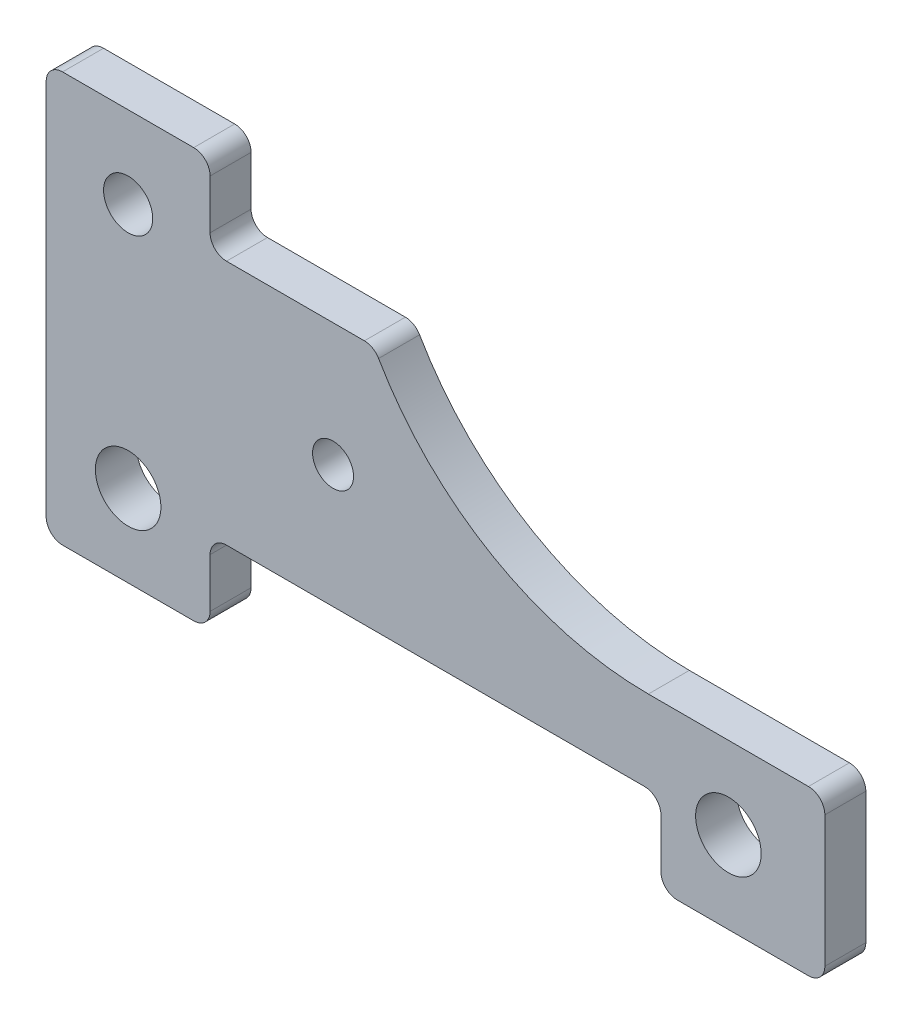
ISO-10303-21;
HEADER;
FILE_DESCRIPTION(('STEP AP214'),'2;1');
FILE_NAME('part.step','',(''),(''),'','','');
FILE_SCHEMA(('AUTOMOTIVE_DESIGN { 1 0 10303 214 1 1 1 1 }'));
ENDSEC;
DATA;
#1=APPLICATION_CONTEXT('core data for automotive mechanical design processes');
#2=APPLICATION_PROTOCOL_DEFINITION('international standard','automotive_design',2000,#1);
#3=PRODUCT_CONTEXT('',#1,'mechanical');
#4=PRODUCT('Part','Part','',(#3));
#5=PRODUCT_RELATED_PRODUCT_CATEGORY('part','',(#4));
#6=PRODUCT_DEFINITION_FORMATION('','',#4);
#7=PRODUCT_DEFINITION_CONTEXT('part definition',#1,'design');
#8=PRODUCT_DEFINITION('design','',#6,#7);
#9=PRODUCT_DEFINITION_SHAPE('','',#8);
#10=(LENGTH_UNIT() NAMED_UNIT(*) SI_UNIT(.MILLI.,.METRE.));
#11=(NAMED_UNIT(*) PLANE_ANGLE_UNIT() SI_UNIT($,.RADIAN.));
#12=(NAMED_UNIT(*) SI_UNIT($,.STERADIAN.) SOLID_ANGLE_UNIT());
#13=UNCERTAINTY_MEASURE_WITH_UNIT(LENGTH_MEASURE(1.E-05),#10,'distance_accuracy_value','');
#14=(GEOMETRIC_REPRESENTATION_CONTEXT(3) GLOBAL_UNCERTAINTY_ASSIGNED_CONTEXT((#13)) GLOBAL_UNIT_ASSIGNED_CONTEXT((#10,
#11,#12)) REPRESENTATION_CONTEXT('',''));
#15=CARTESIAN_POINT('',(0.,0.,0.));
#16=DIRECTION('',(0.,0.,1.));
#17=DIRECTION('',(1.,0.,0.));
#18=AXIS2_PLACEMENT_3D('',#15,#16,#17);
#19=CARTESIAN_POINT('',(734.66401061363,580.,25.));
#20=DIRECTION('',(0.,0.,-1.));
#21=DIRECTION('',(-1.,0.,0.));
#22=AXIS2_PLACEMENT_3D('',#19,#20,#21);
#23=CYLINDRICAL_SURFACE('',#22,380.);
#24=CARTESIAN_POINT('',(734.66401061363,580.,-25.));
#25=DIRECTION('',(0.,0.,-1.));
#26=DIRECTION('',(-1.,0.,0.));
#27=AXIS2_PLACEMENT_3D('',#24,#25,#26);
#28=CIRCLE('',#27,380.);
#29=CARTESIAN_POINT('',(734.66401061363,200.,-25.));
#30=VERTEX_POINT('',#29);
#31=CARTESIAN_POINT('',(405.574357175544,390.,-25.));
#32=VERTEX_POINT('',#31);
#33=EDGE_CURVE('E221',#30,#32,#28,.T.);
#34=ORIENTED_EDGE('',*,*,#33,.T.);
#35=DIRECTION('',(0.,0.,-1.));
#36=VECTOR('',#35,1.);
#37=CARTESIAN_POINT('',(405.574357175544,390.,25.));
#38=LINE('',#37,#36);
#39=CARTESIAN_POINT('',(405.574357175544,390.,25.));
#40=VERTEX_POINT('',#39);
#41=EDGE_CURVE('E11',#40,#32,#38,.T.);
#42=ORIENTED_EDGE('',*,*,#41,.F.);
#43=CARTESIAN_POINT('',(734.66401061363,580.,25.));
#44=DIRECTION('',(0.,0.,-1.));
#45=DIRECTION('',(-1.,0.,0.));
#46=AXIS2_PLACEMENT_3D('',#43,#44,#45);
#47=CIRCLE('',#46,380.);
#48=CARTESIAN_POINT('',(734.66401061363,200.,25.));
#49=VERTEX_POINT('',#48);
#50=EDGE_CURVE('E266',#49,#40,#47,.T.);
#51=ORIENTED_EDGE('',*,*,#50,.F.);
#52=DIRECTION('',(0.,0.,-1.));
#53=VECTOR('',#52,1.);
#54=CARTESIAN_POINT('',(734.66401061363,200.,25.));
#55=LINE('',#54,#53);
#56=EDGE_CURVE('E217',#49,#30,#55,.T.);
#57=ORIENTED_EDGE('',*,*,#56,.T.);
#58=EDGE_LOOP('',(#34,#42,#51,#57));
#59=FACE_BOUND('',#58,.T.);
#60=ADVANCED_FACE('F35',(#59),#23,.F.);
#61=CARTESIAN_POINT('',(388.253849099855,380.,25.));
#62=DIRECTION('',(0.,0.,-1.));
#63=DIRECTION('',(-1.,0.,0.));
#64=AXIS2_PLACEMENT_3D('',#61,#62,#63);
#65=CYLINDRICAL_SURFACE('',#64,20.);
#66=CARTESIAN_POINT('',(388.253849099855,380.,-25.));
#67=DIRECTION('',(0.,0.,1.));
#68=DIRECTION('',(1.,0.,0.));
#69=AXIS2_PLACEMENT_3D('',#66,#67,#68);
#70=CIRCLE('',#69,20.);
#71=CARTESIAN_POINT('',(388.253849099855,400.,-25.));
#72=VERTEX_POINT('',#71);
#73=EDGE_CURVE('E224',#32,#72,#70,.T.);
#74=ORIENTED_EDGE('',*,*,#73,.T.);
#75=DIRECTION('',(0.,0.,-1.));
#76=VECTOR('',#75,1.);
#77=CARTESIAN_POINT('',(388.253849099855,400.,25.));
#78=LINE('',#77,#76);
#79=CARTESIAN_POINT('',(388.253849099855,400.,25.));
#80=VERTEX_POINT('',#79);
#81=EDGE_CURVE('E43',#80,#72,#78,.T.);
#82=ORIENTED_EDGE('',*,*,#81,.F.);
#83=CARTESIAN_POINT('',(388.253849099855,380.,25.));
#84=DIRECTION('',(0.,0.,1.));
#85=DIRECTION('',(1.,0.,0.));
#86=AXIS2_PLACEMENT_3D('',#83,#84,#85);
#87=CIRCLE('',#86,20.);
#88=EDGE_CURVE('E139',#40,#80,#87,.T.);
#89=ORIENTED_EDGE('',*,*,#88,.F.);
#90=ORIENTED_EDGE('',*,*,#41,.T.);
#91=EDGE_LOOP('',(#74,#82,#89,#90));
#92=FACE_BOUND('',#91,.T.);
#93=ADVANCED_FACE('F400',(#92),#65,.T.);
#94=CARTESIAN_POINT('',(220.,400.,25.));
#95=DIRECTION('',(0.,-1.,0.));
#96=DIRECTION('',(0.,0.,-1.));
#97=AXIS2_PLACEMENT_3D('',#94,#95,#96);
#98=PLANE('',#97);
#99=DIRECTION('',(-1.,0.,0.));
#100=VECTOR('',#99,1.);
#101=CARTESIAN_POINT('',(220.,400.,-25.));
#102=LINE('',#101,#100);
#103=CARTESIAN_POINT('',(220.,400.,-25.));
#104=VERTEX_POINT('',#103);
#105=EDGE_CURVE('E227',#72,#104,#102,.T.);
#106=ORIENTED_EDGE('',*,*,#105,.T.);
#107=DIRECTION('',(0.,0.,-1.));
#108=VECTOR('',#107,1.);
#109=CARTESIAN_POINT('',(220.,400.,25.));
#110=LINE('',#109,#108);
#111=CARTESIAN_POINT('',(220.,400.,25.));
#112=VERTEX_POINT('',#111);
#113=EDGE_CURVE('E318',#112,#104,#110,.T.);
#114=ORIENTED_EDGE('',*,*,#113,.F.);
#115=DIRECTION('',(-1.,0.,0.));
#116=VECTOR('',#115,1.);
#117=CARTESIAN_POINT('',(220.,400.,25.));
#118=LINE('',#117,#116);
#119=EDGE_CURVE('E326',#80,#112,#118,.T.);
#120=ORIENTED_EDGE('',*,*,#119,.F.);
#121=ORIENTED_EDGE('',*,*,#81,.T.);
#122=EDGE_LOOP('',(#106,#114,#120,#121));
#123=FACE_BOUND('',#122,.T.);
#124=ADVANCED_FACE('F324',(#123),#98,.F.);
#125=CARTESIAN_POINT('',(220.,420.,25.));
#126=DIRECTION('',(0.,0.,-1.));
#127=DIRECTION('',(-1.,0.,0.));
#128=AXIS2_PLACEMENT_3D('',#125,#126,#127);
#129=CYLINDRICAL_SURFACE('',#128,20.);
#130=CARTESIAN_POINT('',(220.,420.,-25.));
#131=DIRECTION('',(0.,0.,-1.));
#132=DIRECTION('',(-1.,0.,0.));
#133=AXIS2_PLACEMENT_3D('',#130,#131,#132);
#134=CIRCLE('',#133,20.);
#135=CARTESIAN_POINT('',(200.,420.,-25.));
#136=VERTEX_POINT('',#135);
#137=EDGE_CURVE('E229',#104,#136,#134,.T.);
#138=ORIENTED_EDGE('',*,*,#137,.T.);
#139=DIRECTION('',(0.,0.,-1.));
#140=VECTOR('',#139,1.);
#141=CARTESIAN_POINT('',(200.,420.,25.));
#142=LINE('',#141,#140);
#143=CARTESIAN_POINT('',(200.,420.,25.));
#144=VERTEX_POINT('',#143);
#145=EDGE_CURVE('E315',#144,#136,#142,.T.);
#146=ORIENTED_EDGE('',*,*,#145,.F.);
#147=CARTESIAN_POINT('',(220.,420.,25.));
#148=DIRECTION('',(0.,0.,-1.));
#149=DIRECTION('',(-1.,0.,0.));
#150=AXIS2_PLACEMENT_3D('',#147,#148,#149);
#151=CIRCLE('',#150,20.);
#152=EDGE_CURVE('E344',#112,#144,#151,.T.);
#153=ORIENTED_EDGE('',*,*,#152,.F.);
#154=ORIENTED_EDGE('',*,*,#113,.T.);
#155=EDGE_LOOP('',(#138,#146,#153,#154));
#156=FACE_BOUND('',#155,.T.);
#157=ADVANCED_FACE('F335',(#156),#129,.F.);
#158=CARTESIAN_POINT('',(200.,480.,25.));
#159=DIRECTION('',(-1.,0.,0.));
#160=DIRECTION('',(0.,0.,1.));
#161=AXIS2_PLACEMENT_3D('',#158,#159,#160);
#162=PLANE('',#161);
#163=DIRECTION('',(0.,1.,0.));
#164=VECTOR('',#163,1.);
#165=CARTESIAN_POINT('',(200.,480.,-25.));
#166=LINE('',#165,#164);
#167=CARTESIAN_POINT('',(200.,480.,-25.));
#168=VERTEX_POINT('',#167);
#169=EDGE_CURVE('E231',#136,#168,#166,.T.);
#170=ORIENTED_EDGE('',*,*,#169,.T.);
#171=DIRECTION('',(0.,0.,-1.));
#172=VECTOR('',#171,1.);
#173=CARTESIAN_POINT('',(200.,480.,25.));
#174=LINE('',#173,#172);
#175=CARTESIAN_POINT('',(200.,480.,25.));
#176=VERTEX_POINT('',#175);
#177=EDGE_CURVE('E312',#176,#168,#174,.T.);
#178=ORIENTED_EDGE('',*,*,#177,.F.);
#179=DIRECTION('',(0.,1.,0.));
#180=VECTOR('',#179,1.);
#181=CARTESIAN_POINT('',(200.,480.,25.));
#182=LINE('',#181,#180);
#183=EDGE_CURVE('E341',#144,#176,#182,.T.);
#184=ORIENTED_EDGE('',*,*,#183,.F.);
#185=ORIENTED_EDGE('',*,*,#145,.T.);
#186=EDGE_LOOP('',(#170,#178,#184,#185));
#187=FACE_BOUND('',#186,.T.);
#188=ADVANCED_FACE('F339',(#187),#162,.F.);
#189=CARTESIAN_POINT('',(180.,480.,25.));
#190=DIRECTION('',(0.,0.,-1.));
#191=DIRECTION('',(-1.,0.,0.));
#192=AXIS2_PLACEMENT_3D('',#189,#190,#191);
#193=CYLINDRICAL_SURFACE('',#192,20.);
#194=CARTESIAN_POINT('',(180.,480.,-25.));
#195=DIRECTION('',(0.,0.,1.));
#196=DIRECTION('',(1.,0.,0.));
#197=AXIS2_PLACEMENT_3D('',#194,#195,#196);
#198=CIRCLE('',#197,20.);
#199=CARTESIAN_POINT('',(180.,500.,-25.));
#200=VERTEX_POINT('',#199);
#201=EDGE_CURVE('E233',#168,#200,#198,.T.);
#202=ORIENTED_EDGE('',*,*,#201,.T.);
#203=DIRECTION('',(0.,0.,-1.));
#204=VECTOR('',#203,1.);
#205=CARTESIAN_POINT('',(180.,500.,25.));
#206=LINE('',#205,#204);
#207=CARTESIAN_POINT('',(180.,500.,25.));
#208=VERTEX_POINT('',#207);
#209=EDGE_CURVE('E309',#208,#200,#206,.T.);
#210=ORIENTED_EDGE('',*,*,#209,.F.);
#211=CARTESIAN_POINT('',(180.,480.,25.));
#212=DIRECTION('',(0.,0.,1.));
#213=DIRECTION('',(1.,0.,0.));
#214=AXIS2_PLACEMENT_3D('',#211,#212,#213);
#215=CIRCLE('',#214,20.);
#216=EDGE_CURVE('E343',#176,#208,#215,.T.);
#217=ORIENTED_EDGE('',*,*,#216,.F.);
#218=ORIENTED_EDGE('',*,*,#177,.T.);
#219=EDGE_LOOP('',(#202,#210,#217,#218));
#220=FACE_BOUND('',#219,.T.);
#221=ADVANCED_FACE('F413',(#220),#193,.T.);
#222=CARTESIAN_POINT('',(20.0000000000001,500.,25.));
#223=DIRECTION('',(0.,-1.,0.));
#224=DIRECTION('',(0.,0.,-1.));
#225=AXIS2_PLACEMENT_3D('',#222,#223,#224);
#226=PLANE('',#225);
#227=DIRECTION('',(-1.,0.,0.));
#228=VECTOR('',#227,1.);
#229=CARTESIAN_POINT('',(20.0000000000001,500.,-25.));
#230=LINE('',#229,#228);
#231=CARTESIAN_POINT('',(20.0000000000001,500.,-25.));
#232=VERTEX_POINT('',#231);
#233=EDGE_CURVE('E235',#200,#232,#230,.T.);
#234=ORIENTED_EDGE('',*,*,#233,.T.);
#235=DIRECTION('',(0.,0.,-1.));
#236=VECTOR('',#235,1.);
#237=CARTESIAN_POINT('',(20.0000000000001,500.,25.));
#238=LINE('',#237,#236);
#239=CARTESIAN_POINT('',(20.0000000000001,500.,25.));
#240=VERTEX_POINT('',#239);
#241=EDGE_CURVE('E306',#240,#232,#238,.T.);
#242=ORIENTED_EDGE('',*,*,#241,.F.);
#243=DIRECTION('',(-1.,0.,0.));
#244=VECTOR('',#243,1.);
#245=CARTESIAN_POINT('',(20.0000000000001,500.,25.));
#246=LINE('',#245,#244);
#247=EDGE_CURVE('E346',#208,#240,#246,.T.);
#248=ORIENTED_EDGE('',*,*,#247,.F.);
#249=ORIENTED_EDGE('',*,*,#209,.T.);
#250=EDGE_LOOP('',(#234,#242,#248,#249));
#251=FACE_BOUND('',#250,.T.);
#252=ADVANCED_FACE('F416',(#251),#226,.F.);
#253=CARTESIAN_POINT('',(20.,480.,25.));
#254=DIRECTION('',(0.,0.,-1.));
#255=DIRECTION('',(-1.,0.,0.));
#256=AXIS2_PLACEMENT_3D('',#253,#254,#255);
#257=CYLINDRICAL_SURFACE('',#256,20.);
#258=CARTESIAN_POINT('',(20.,480.,-25.));
#259=DIRECTION('',(0.,0.,1.));
#260=DIRECTION('',(-1.,0.,0.));
#261=AXIS2_PLACEMENT_3D('',#258,#259,#260);
#262=CIRCLE('',#261,20.);
#263=CARTESIAN_POINT('',(0.,480.,-25.));
#264=VERTEX_POINT('',#263);
#265=EDGE_CURVE('E237',#232,#264,#262,.T.);
#266=ORIENTED_EDGE('',*,*,#265,.T.);
#267=DIRECTION('',(0.,0.,-1.));
#268=VECTOR('',#267,1.);
#269=CARTESIAN_POINT('',(0.,480.,25.));
#270=LINE('',#269,#268);
#271=CARTESIAN_POINT('',(0.,480.,25.));
#272=VERTEX_POINT('',#271);
#273=EDGE_CURVE('E303',#272,#264,#270,.T.);
#274=ORIENTED_EDGE('',*,*,#273,.F.);
#275=CARTESIAN_POINT('',(20.,480.,25.));
#276=DIRECTION('',(0.,0.,1.));
#277=DIRECTION('',(-1.,0.,0.));
#278=AXIS2_PLACEMENT_3D('',#275,#276,#277);
#279=CIRCLE('',#278,20.);
#280=EDGE_CURVE('E352',#240,#272,#279,.T.);
#281=ORIENTED_EDGE('',*,*,#280,.F.);
#282=ORIENTED_EDGE('',*,*,#241,.T.);
#283=EDGE_LOOP('',(#266,#274,#281,#282));
#284=FACE_BOUND('',#283,.T.);
#285=ADVANCED_FACE('F420',(#284),#257,.T.);
#286=CARTESIAN_POINT('',(0.,20.0000000000001,25.));
#287=DIRECTION('',(1.,0.,0.));
#288=DIRECTION('',(0.,0.,-1.));
#289=AXIS2_PLACEMENT_3D('',#286,#287,#288);
#290=PLANE('',#289);
#291=DIRECTION('',(0.,-1.,0.));
#292=VECTOR('',#291,1.);
#293=CARTESIAN_POINT('',(0.,20.0000000000001,-25.));
#294=LINE('',#293,#292);
#295=CARTESIAN_POINT('',(0.,20.0000000000001,-25.));
#296=VERTEX_POINT('',#295);
#297=EDGE_CURVE('E239',#264,#296,#294,.T.);
#298=ORIENTED_EDGE('',*,*,#297,.T.);
#299=DIRECTION('',(0.,0.,-1.));
#300=VECTOR('',#299,1.);
#301=CARTESIAN_POINT('',(0.,20.0000000000001,25.));
#302=LINE('',#301,#300);
#303=CARTESIAN_POINT('',(0.,20.0000000000001,25.));
#304=VERTEX_POINT('',#303);
#305=EDGE_CURVE('E300',#304,#296,#302,.T.);
#306=ORIENTED_EDGE('',*,*,#305,.F.);
#307=DIRECTION('',(0.,-1.,0.));
#308=VECTOR('',#307,1.);
#309=CARTESIAN_POINT('',(0.,20.0000000000001,25.));
#310=LINE('',#309,#308);
#311=EDGE_CURVE('E354',#272,#304,#310,.T.);
#312=ORIENTED_EDGE('',*,*,#311,.F.);
#313=ORIENTED_EDGE('',*,*,#273,.T.);
#314=EDGE_LOOP('',(#298,#306,#312,#313));
#315=FACE_BOUND('',#314,.T.);
#316=ADVANCED_FACE('F424',(#315),#290,.F.);
#317=CARTESIAN_POINT('',(20.,20.,25.));
#318=DIRECTION('',(0.,0.,-1.));
#319=DIRECTION('',(-1.,0.,0.));
#320=AXIS2_PLACEMENT_3D('',#317,#318,#319);
#321=CYLINDRICAL_SURFACE('',#320,20.);
#322=CARTESIAN_POINT('',(20.,20.,-25.));
#323=DIRECTION('',(0.,0.,1.));
#324=DIRECTION('',(1.,0.,0.));
#325=AXIS2_PLACEMENT_3D('',#322,#323,#324);
#326=CIRCLE('',#325,20.);
#327=CARTESIAN_POINT('',(20.0000000000001,0.,-25.));
#328=VERTEX_POINT('',#327);
#329=EDGE_CURVE('E241',#296,#328,#326,.T.);
#330=ORIENTED_EDGE('',*,*,#329,.T.);
#331=DIRECTION('',(0.,0.,-1.));
#332=VECTOR('',#331,1.);
#333=CARTESIAN_POINT('',(20.0000000000001,0.,25.));
#334=LINE('',#333,#332);
#335=CARTESIAN_POINT('',(20.0000000000001,0.,25.));
#336=VERTEX_POINT('',#335);
#337=EDGE_CURVE('E297',#336,#328,#334,.T.);
#338=ORIENTED_EDGE('',*,*,#337,.F.);
#339=CARTESIAN_POINT('',(20.,20.,25.));
#340=DIRECTION('',(0.,0.,1.));
#341=DIRECTION('',(1.,0.,0.));
#342=AXIS2_PLACEMENT_3D('',#339,#340,#341);
#343=CIRCLE('',#342,20.);
#344=EDGE_CURVE('E356',#304,#336,#343,.T.);
#345=ORIENTED_EDGE('',*,*,#344,.F.);
#346=ORIENTED_EDGE('',*,*,#305,.T.);
#347=EDGE_LOOP('',(#330,#338,#345,#346));
#348=FACE_BOUND('',#347,.T.);
#349=ADVANCED_FACE('F428',(#348),#321,.T.);
#350=CARTESIAN_POINT('',(20.0000000000001,0.,25.));
#351=DIRECTION('',(0.,1.,0.));
#352=DIRECTION('',(0.,0.,1.));
#353=AXIS2_PLACEMENT_3D('',#350,#351,#352);
#354=PLANE('',#353);
#355=DIRECTION('',(1.,0.,0.));
#356=VECTOR('',#355,1.);
#357=CARTESIAN_POINT('',(20.0000000000001,0.,-25.));
#358=LINE('',#357,#356);
#359=CARTESIAN_POINT('',(180.,0.,-25.));
#360=VERTEX_POINT('',#359);
#361=EDGE_CURVE('E243',#328,#360,#358,.T.);
#362=ORIENTED_EDGE('',*,*,#361,.T.);
#363=DIRECTION('',(0.,0.,-1.));
#364=VECTOR('',#363,1.);
#365=CARTESIAN_POINT('',(180.,0.,25.));
#366=LINE('',#365,#364);
#367=CARTESIAN_POINT('',(180.,0.,25.));
#368=VERTEX_POINT('',#367);
#369=EDGE_CURVE('E294',#368,#360,#366,.T.);
#370=ORIENTED_EDGE('',*,*,#369,.F.);
#371=DIRECTION('',(1.,0.,0.));
#372=VECTOR('',#371,1.);
#373=CARTESIAN_POINT('',(20.0000000000001,0.,25.));
#374=LINE('',#373,#372);
#375=EDGE_CURVE('E358',#336,#368,#374,.T.);
#376=ORIENTED_EDGE('',*,*,#375,.F.);
#377=ORIENTED_EDGE('',*,*,#337,.T.);
#378=EDGE_LOOP('',(#362,#370,#376,#377));
#379=FACE_BOUND('',#378,.T.);
#380=ADVANCED_FACE('F432',(#379),#354,.F.);
#381=CARTESIAN_POINT('',(180.,20.,25.));
#382=DIRECTION('',(0.,0.,-1.));
#383=DIRECTION('',(-1.,0.,0.));
#384=AXIS2_PLACEMENT_3D('',#381,#382,#383);
#385=CYLINDRICAL_SURFACE('',#384,20.);
#386=CARTESIAN_POINT('',(180.,20.,-25.));
#387=DIRECTION('',(0.,0.,1.));
#388=DIRECTION('',(1.,0.,0.));
#389=AXIS2_PLACEMENT_3D('',#386,#387,#388);
#390=CIRCLE('',#389,20.);
#391=CARTESIAN_POINT('',(200.,20.0000000000001,-25.));
#392=VERTEX_POINT('',#391);
#393=EDGE_CURVE('E245',#360,#392,#390,.T.);
#394=ORIENTED_EDGE('',*,*,#393,.T.);
#395=DIRECTION('',(0.,0.,-1.));
#396=VECTOR('',#395,1.);
#397=CARTESIAN_POINT('',(200.,20.0000000000001,25.));
#398=LINE('',#397,#396);
#399=CARTESIAN_POINT('',(200.,20.0000000000001,25.));
#400=VERTEX_POINT('',#399);
#401=EDGE_CURVE('E291',#400,#392,#398,.T.);
#402=ORIENTED_EDGE('',*,*,#401,.F.);
#403=CARTESIAN_POINT('',(180.,20.,25.));
#404=DIRECTION('',(0.,0.,1.));
#405=DIRECTION('',(1.,0.,0.));
#406=AXIS2_PLACEMENT_3D('',#403,#404,#405);
#407=CIRCLE('',#406,20.);
#408=EDGE_CURVE('E360',#368,#400,#407,.T.);
#409=ORIENTED_EDGE('',*,*,#408,.F.);
#410=ORIENTED_EDGE('',*,*,#369,.T.);
#411=EDGE_LOOP('',(#394,#402,#409,#410));
#412=FACE_BOUND('',#411,.T.);
#413=ADVANCED_FACE('F436',(#412),#385,.T.);
#414=CARTESIAN_POINT('',(200.,20.0000000000001,25.));
#415=DIRECTION('',(-1.,0.,0.));
#416=DIRECTION('',(0.,0.,1.));
#417=AXIS2_PLACEMENT_3D('',#414,#415,#416);
#418=PLANE('',#417);
#419=DIRECTION('',(0.,1.,0.));
#420=VECTOR('',#419,1.);
#421=CARTESIAN_POINT('',(200.,20.0000000000001,-25.));
#422=LINE('',#421,#420);
#423=CARTESIAN_POINT('',(200.,79.9999999999998,-25.));
#424=VERTEX_POINT('',#423);
#425=EDGE_CURVE('E247',#392,#424,#422,.T.);
#426=ORIENTED_EDGE('',*,*,#425,.T.);
#427=DIRECTION('',(0.,0.,-1.));
#428=VECTOR('',#427,1.);
#429=CARTESIAN_POINT('',(200.,79.9999999999998,25.));
#430=LINE('',#429,#428);
#431=CARTESIAN_POINT('',(200.,79.9999999999998,25.));
#432=VERTEX_POINT('',#431);
#433=EDGE_CURVE('E288',#432,#424,#430,.T.);
#434=ORIENTED_EDGE('',*,*,#433,.F.);
#435=DIRECTION('',(0.,1.,0.));
#436=VECTOR('',#435,1.);
#437=CARTESIAN_POINT('',(200.,20.0000000000001,25.));
#438=LINE('',#437,#436);
#439=EDGE_CURVE('E362',#400,#432,#438,.T.);
#440=ORIENTED_EDGE('',*,*,#439,.F.);
#441=ORIENTED_EDGE('',*,*,#401,.T.);
#442=EDGE_LOOP('',(#426,#434,#440,#441));
#443=FACE_BOUND('',#442,.T.);
#444=ADVANCED_FACE('F440',(#443),#418,.F.);
#445=CARTESIAN_POINT('',(220.,80.,25.));
#446=DIRECTION('',(0.,0.,-1.));
#447=DIRECTION('',(-1.,0.,0.));
#448=AXIS2_PLACEMENT_3D('',#445,#446,#447);
#449=CYLINDRICAL_SURFACE('',#448,20.);
#450=CARTESIAN_POINT('',(220.,80.,-25.));
#451=DIRECTION('',(0.,0.,-1.));
#452=DIRECTION('',(-1.,0.,0.));
#453=AXIS2_PLACEMENT_3D('',#450,#451,#452);
#454=CIRCLE('',#453,20.);
#455=CARTESIAN_POINT('',(220.,100.,-25.));
#456=VERTEX_POINT('',#455);
#457=EDGE_CURVE('E249',#424,#456,#454,.T.);
#458=ORIENTED_EDGE('',*,*,#457,.T.);
#459=DIRECTION('',(0.,0.,-1.));
#460=VECTOR('',#459,1.);
#461=CARTESIAN_POINT('',(220.,100.,25.));
#462=LINE('',#461,#460);
#463=CARTESIAN_POINT('',(220.,100.,25.));
#464=VERTEX_POINT('',#463);
#465=EDGE_CURVE('E285',#464,#456,#462,.T.);
#466=ORIENTED_EDGE('',*,*,#465,.F.);
#467=CARTESIAN_POINT('',(220.,80.,25.));
#468=DIRECTION('',(0.,0.,-1.));
#469=DIRECTION('',(-1.,0.,0.));
#470=AXIS2_PLACEMENT_3D('',#467,#468,#469);
#471=CIRCLE('',#470,20.);
#472=EDGE_CURVE('E364',#432,#464,#471,.T.);
#473=ORIENTED_EDGE('',*,*,#472,.F.);
#474=ORIENTED_EDGE('',*,*,#433,.T.);
#475=EDGE_LOOP('',(#458,#466,#473,#474));
#476=FACE_BOUND('',#475,.T.);
#477=ADVANCED_FACE('F444',(#476),#449,.F.);
#478=CARTESIAN_POINT('',(220.,100.,25.));
#479=DIRECTION('',(0.,1.,0.));
#480=DIRECTION('',(0.,0.,1.));
#481=AXIS2_PLACEMENT_3D('',#478,#479,#480);
#482=PLANE('',#481);
#483=DIRECTION('',(1.,0.,0.));
#484=VECTOR('',#483,1.);
#485=CARTESIAN_POINT('',(220.,100.,-25.));
#486=LINE('',#485,#484);
#487=CARTESIAN_POINT('',(730.,100.,-25.));
#488=VERTEX_POINT('',#487);
#489=EDGE_CURVE('E251',#456,#488,#486,.T.);
#490=ORIENTED_EDGE('',*,*,#489,.T.);
#491=DIRECTION('',(0.,0.,-1.));
#492=VECTOR('',#491,1.);
#493=CARTESIAN_POINT('',(730.,100.,25.));
#494=LINE('',#493,#492);
#495=CARTESIAN_POINT('',(730.,100.,25.));
#496=VERTEX_POINT('',#495);
#497=EDGE_CURVE('E282',#496,#488,#494,.T.);
#498=ORIENTED_EDGE('',*,*,#497,.F.);
#499=DIRECTION('',(1.,0.,0.));
#500=VECTOR('',#499,1.);
#501=CARTESIAN_POINT('',(220.,100.,25.));
#502=LINE('',#501,#500);
#503=EDGE_CURVE('E366',#464,#496,#502,.T.);
#504=ORIENTED_EDGE('',*,*,#503,.F.);
#505=ORIENTED_EDGE('',*,*,#465,.T.);
#506=EDGE_LOOP('',(#490,#498,#504,#505));
#507=FACE_BOUND('',#506,.T.);
#508=ADVANCED_FACE('F448',(#507),#482,.F.);
#509=CARTESIAN_POINT('',(730.,80.,25.));
#510=DIRECTION('',(0.,0.,-1.));
#511=DIRECTION('',(-1.,0.,0.));
#512=AXIS2_PLACEMENT_3D('',#509,#510,#511);
#513=CYLINDRICAL_SURFACE('',#512,20.);
#514=CARTESIAN_POINT('',(730.,80.,-25.));
#515=DIRECTION('',(0.,0.,-1.));
#516=DIRECTION('',(1.,0.,0.));
#517=AXIS2_PLACEMENT_3D('',#514,#515,#516);
#518=CIRCLE('',#517,20.);
#519=CARTESIAN_POINT('',(750.,79.9999999999998,-25.));
#520=VERTEX_POINT('',#519);
#521=EDGE_CURVE('E253',#488,#520,#518,.T.);
#522=ORIENTED_EDGE('',*,*,#521,.T.);
#523=DIRECTION('',(0.,0.,-1.));
#524=VECTOR('',#523,1.);
#525=CARTESIAN_POINT('',(750.,79.9999999999998,25.));
#526=LINE('',#525,#524);
#527=CARTESIAN_POINT('',(750.,79.9999999999998,25.));
#528=VERTEX_POINT('',#527);
#529=EDGE_CURVE('E279',#528,#520,#526,.T.);
#530=ORIENTED_EDGE('',*,*,#529,.F.);
#531=CARTESIAN_POINT('',(730.,80.,25.));
#532=DIRECTION('',(0.,0.,-1.));
#533=DIRECTION('',(1.,0.,0.));
#534=AXIS2_PLACEMENT_3D('',#531,#532,#533);
#535=CIRCLE('',#534,20.);
#536=EDGE_CURVE('E368',#496,#528,#535,.T.);
#537=ORIENTED_EDGE('',*,*,#536,.F.);
#538=ORIENTED_EDGE('',*,*,#497,.T.);
#539=EDGE_LOOP('',(#522,#530,#537,#538));
#540=FACE_BOUND('',#539,.T.);
#541=ADVANCED_FACE('F452',(#540),#513,.F.);
#542=CARTESIAN_POINT('',(750.,79.9999999999998,25.));
#543=DIRECTION('',(1.,0.,0.));
#544=DIRECTION('',(0.,0.,-1.));
#545=AXIS2_PLACEMENT_3D('',#542,#543,#544);
#546=PLANE('',#545);
#547=DIRECTION('',(0.,-1.,0.));
#548=VECTOR('',#547,1.);
#549=CARTESIAN_POINT('',(750.,79.9999999999998,-25.));
#550=LINE('',#549,#548);
#551=CARTESIAN_POINT('',(750.,20.0000000000001,-25.));
#552=VERTEX_POINT('',#551);
#553=EDGE_CURVE('E255',#520,#552,#550,.T.);
#554=ORIENTED_EDGE('',*,*,#553,.T.);
#555=DIRECTION('',(0.,0.,-1.));
#556=VECTOR('',#555,1.);
#557=CARTESIAN_POINT('',(750.,20.0000000000001,25.));
#558=LINE('',#557,#556);
#559=CARTESIAN_POINT('',(750.,20.0000000000001,25.));
#560=VERTEX_POINT('',#559);
#561=EDGE_CURVE('E276',#560,#552,#558,.T.);
#562=ORIENTED_EDGE('',*,*,#561,.F.);
#563=DIRECTION('',(0.,-1.,0.));
#564=VECTOR('',#563,1.);
#565=CARTESIAN_POINT('',(750.,79.9999999999998,25.));
#566=LINE('',#565,#564);
#567=EDGE_CURVE('E370',#528,#560,#566,.T.);
#568=ORIENTED_EDGE('',*,*,#567,.F.);
#569=ORIENTED_EDGE('',*,*,#529,.T.);
#570=EDGE_LOOP('',(#554,#562,#568,#569));
#571=FACE_BOUND('',#570,.T.);
#572=ADVANCED_FACE('F456',(#571),#546,.F.);
#573=CARTESIAN_POINT('',(770.,20.,25.));
#574=DIRECTION('',(0.,0.,-1.));
#575=DIRECTION('',(-1.,0.,0.));
#576=AXIS2_PLACEMENT_3D('',#573,#574,#575);
#577=CYLINDRICAL_SURFACE('',#576,20.);
#578=CARTESIAN_POINT('',(770.,20.,-25.));
#579=DIRECTION('',(0.,0.,1.));
#580=DIRECTION('',(1.,0.,0.));
#581=AXIS2_PLACEMENT_3D('',#578,#579,#580);
#582=CIRCLE('',#581,20.);
#583=CARTESIAN_POINT('',(770.,0.,-25.));
#584=VERTEX_POINT('',#583);
#585=EDGE_CURVE('E257',#552,#584,#582,.T.);
#586=ORIENTED_EDGE('',*,*,#585,.T.);
#587=DIRECTION('',(0.,0.,-1.));
#588=VECTOR('',#587,1.);
#589=CARTESIAN_POINT('',(770.,0.,25.));
#590=LINE('',#589,#588);
#591=CARTESIAN_POINT('',(770.,0.,25.));
#592=VERTEX_POINT('',#591);
#593=EDGE_CURVE('E273',#592,#584,#590,.T.);
#594=ORIENTED_EDGE('',*,*,#593,.F.);
#595=CARTESIAN_POINT('',(770.,20.,25.));
#596=DIRECTION('',(0.,0.,1.));
#597=DIRECTION('',(1.,0.,0.));
#598=AXIS2_PLACEMENT_3D('',#595,#596,#597);
#599=CIRCLE('',#598,20.);
#600=EDGE_CURVE('E372',#560,#592,#599,.T.);
#601=ORIENTED_EDGE('',*,*,#600,.F.);
#602=ORIENTED_EDGE('',*,*,#561,.T.);
#603=EDGE_LOOP('',(#586,#594,#601,#602));
#604=FACE_BOUND('',#603,.T.);
#605=ADVANCED_FACE('F460',(#604),#577,.T.);
#606=CARTESIAN_POINT('',(770.,0.,25.));
#607=DIRECTION('',(0.,1.,0.));
#608=DIRECTION('',(0.,0.,1.));
#609=AXIS2_PLACEMENT_3D('',#606,#607,#608);
#610=PLANE('',#609);
#611=DIRECTION('',(1.,0.,0.));
#612=VECTOR('',#611,1.);
#613=CARTESIAN_POINT('',(770.,0.,-25.));
#614=LINE('',#613,#612);
#615=CARTESIAN_POINT('',(930.,0.,-25.));
#616=VERTEX_POINT('',#615);
#617=EDGE_CURVE('E259',#584,#616,#614,.T.);
#618=ORIENTED_EDGE('',*,*,#617,.T.);
#619=DIRECTION('',(0.,0.,-1.));
#620=VECTOR('',#619,1.);
#621=CARTESIAN_POINT('',(930.,0.,25.));
#622=LINE('',#621,#620);
#623=CARTESIAN_POINT('',(930.,0.,25.));
#624=VERTEX_POINT('',#623);
#625=EDGE_CURVE('E270',#624,#616,#622,.T.);
#626=ORIENTED_EDGE('',*,*,#625,.F.);
#627=DIRECTION('',(1.,0.,0.));
#628=VECTOR('',#627,1.);
#629=CARTESIAN_POINT('',(770.,0.,25.));
#630=LINE('',#629,#628);
#631=EDGE_CURVE('E374',#592,#624,#630,.T.);
#632=ORIENTED_EDGE('',*,*,#631,.F.);
#633=ORIENTED_EDGE('',*,*,#593,.T.);
#634=EDGE_LOOP('',(#618,#626,#632,#633));
#635=FACE_BOUND('',#634,.T.);
#636=ADVANCED_FACE('F380',(#635),#610,.F.);
#637=CARTESIAN_POINT('',(930.,20.,25.));
#638=DIRECTION('',(0.,0.,-1.));
#639=DIRECTION('',(-1.,0.,0.));
#640=AXIS2_PLACEMENT_3D('',#637,#638,#639);
#641=CYLINDRICAL_SURFACE('',#640,20.);
#642=CARTESIAN_POINT('',(930.,20.,-25.));
#643=DIRECTION('',(0.,0.,1.));
#644=DIRECTION('',(1.,0.,0.));
#645=AXIS2_PLACEMENT_3D('',#642,#643,#644);
#646=CIRCLE('',#645,20.);
#647=CARTESIAN_POINT('',(950.,20.0000000000001,-25.));
#648=VERTEX_POINT('',#647);
#649=EDGE_CURVE('E261',#616,#648,#646,.T.);
#650=ORIENTED_EDGE('',*,*,#649,.T.);
#651=DIRECTION('',(0.,0.,-1.));
#652=VECTOR('',#651,1.);
#653=CARTESIAN_POINT('',(950.,20.0000000000001,25.));
#654=LINE('',#653,#652);
#655=CARTESIAN_POINT('',(950.,20.0000000000001,25.));
#656=VERTEX_POINT('',#655);
#657=EDGE_CURVE('E212',#656,#648,#654,.T.);
#658=ORIENTED_EDGE('',*,*,#657,.F.);
#659=CARTESIAN_POINT('',(930.,20.,25.));
#660=DIRECTION('',(0.,0.,1.));
#661=DIRECTION('',(1.,0.,0.));
#662=AXIS2_PLACEMENT_3D('',#659,#660,#661);
#663=CIRCLE('',#662,20.);
#664=EDGE_CURVE('E203',#624,#656,#663,.T.);
#665=ORIENTED_EDGE('',*,*,#664,.F.);
#666=ORIENTED_EDGE('',*,*,#625,.T.);
#667=EDGE_LOOP('',(#650,#658,#665,#666));
#668=FACE_BOUND('',#667,.T.);
#669=ADVANCED_FACE('F384',(#668),#641,.T.);
#670=CARTESIAN_POINT('',(950.,20.0000000000001,25.));
#671=DIRECTION('',(-1.,0.,0.));
#672=DIRECTION('',(0.,0.,1.));
#673=AXIS2_PLACEMENT_3D('',#670,#671,#672);
#674=PLANE('',#673);
#675=DIRECTION('',(0.,1.,0.));
#676=VECTOR('',#675,1.);
#677=CARTESIAN_POINT('',(950.,20.0000000000001,-25.));
#678=LINE('',#677,#676);
#679=CARTESIAN_POINT('',(950.,180.,-25.));
#680=VERTEX_POINT('',#679);
#681=EDGE_CURVE('E211',#648,#680,#678,.T.);
#682=ORIENTED_EDGE('',*,*,#681,.T.);
#683=DIRECTION('',(0.,0.,-1.));
#684=VECTOR('',#683,1.);
#685=CARTESIAN_POINT('',(950.,180.,25.));
#686=LINE('',#685,#684);
#687=CARTESIAN_POINT('',(950.,180.,25.));
#688=VERTEX_POINT('',#687);
#689=EDGE_CURVE('E208',#688,#680,#686,.T.);
#690=ORIENTED_EDGE('',*,*,#689,.F.);
#691=DIRECTION('',(0.,1.,0.));
#692=VECTOR('',#691,1.);
#693=CARTESIAN_POINT('',(950.,20.0000000000001,25.));
#694=LINE('',#693,#692);
#695=EDGE_CURVE('E197',#656,#688,#694,.T.);
#696=ORIENTED_EDGE('',*,*,#695,.F.);
#697=ORIENTED_EDGE('',*,*,#657,.T.);
#698=EDGE_LOOP('',(#682,#690,#696,#697));
#699=FACE_BOUND('',#698,.T.);
#700=ADVANCED_FACE('F209',(#699),#674,.F.);
#701=CARTESIAN_POINT('',(930.,180.,25.));
#702=DIRECTION('',(0.,0.,-1.));
#703=DIRECTION('',(-1.,0.,0.));
#704=AXIS2_PLACEMENT_3D('',#701,#702,#703);
#705=CYLINDRICAL_SURFACE('',#704,20.);
#706=CARTESIAN_POINT('',(930.,180.,-25.));
#707=DIRECTION('',(0.,0.,1.));
#708=DIRECTION('',(1.,0.,0.));
#709=AXIS2_PLACEMENT_3D('',#706,#707,#708);
#710=CIRCLE('',#709,20.);
#711=CARTESIAN_POINT('',(930.,200.,-25.));
#712=VERTEX_POINT('',#711);
#713=EDGE_CURVE('E125',#680,#712,#710,.T.);
#714=ORIENTED_EDGE('',*,*,#713,.T.);
#715=DIRECTION('',(0.,0.,-1.));
#716=VECTOR('',#715,1.);
#717=CARTESIAN_POINT('',(930.,200.,25.));
#718=LINE('',#717,#716);
#719=CARTESIAN_POINT('',(930.,200.,25.));
#720=VERTEX_POINT('',#719);
#721=EDGE_CURVE('E213',#720,#712,#718,.T.);
#722=ORIENTED_EDGE('',*,*,#721,.F.);
#723=CARTESIAN_POINT('',(930.,180.,25.));
#724=DIRECTION('',(0.,0.,1.));
#725=DIRECTION('',(1.,0.,0.));
#726=AXIS2_PLACEMENT_3D('',#723,#724,#725);
#727=CIRCLE('',#726,20.);
#728=EDGE_CURVE('E201',#688,#720,#727,.T.);
#729=ORIENTED_EDGE('',*,*,#728,.F.);
#730=ORIENTED_EDGE('',*,*,#689,.T.);
#731=EDGE_LOOP('',(#714,#722,#729,#730));
#732=FACE_BOUND('',#731,.T.);
#733=ADVANCED_FACE('F215',(#732),#705,.T.);
#734=CARTESIAN_POINT('',(930.,200.,25.));
#735=DIRECTION('',(0.,-1.,0.));
#736=DIRECTION('',(0.,0.,-1.));
#737=AXIS2_PLACEMENT_3D('',#734,#735,#736);
#738=PLANE('',#737);
#739=DIRECTION('',(-1.,0.,0.));
#740=VECTOR('',#739,1.);
#741=CARTESIAN_POINT('',(930.,200.,-25.));
#742=LINE('',#741,#740);
#743=EDGE_CURVE('E131',#712,#30,#742,.T.);
#744=ORIENTED_EDGE('',*,*,#743,.T.);
#745=ORIENTED_EDGE('',*,*,#56,.F.);
#746=DIRECTION('',(-1.,0.,0.));
#747=VECTOR('',#746,1.);
#748=CARTESIAN_POINT('',(930.,200.,25.));
#749=LINE('',#748,#747);
#750=EDGE_CURVE('E51',#720,#49,#749,.T.);
#751=ORIENTED_EDGE('',*,*,#750,.F.);
#752=ORIENTED_EDGE('',*,*,#721,.T.);
#753=EDGE_LOOP('',(#744,#745,#751,#752));
#754=FACE_BOUND('',#753,.T.);
#755=ADVANCED_FACE('F388',(#754),#738,.F.);
#756=CARTESIAN_POINT('',(734.66401061363,580.,25.));
#757=DIRECTION('',(0.,0.,-1.));
#758=DIRECTION('',(-1.,0.,0.));
#759=AXIS2_PLACEMENT_3D('',#756,#757,#758);
#760=PLANE('',#759);
#761=CARTESIAN_POINT('',(100.,400.,25.));
#762=DIRECTION('',(0.,0.,1.));
#763=DIRECTION('',(1.,0.,0.));
#764=AXIS2_PLACEMENT_3D('',#761,#762,#763);
#765=CIRCLE('',#764,30.);
#766=CARTESIAN_POINT('',(130.,400.,25.));
#767=VERTEX_POINT('',#766);
#768=EDGE_CURVE('E546',#767,#767,#765,.T.);
#769=ORIENTED_EDGE('',*,*,#768,.F.);
#770=EDGE_LOOP('',(#769));
#771=FACE_BOUND('',#770,.T.);
#772=CARTESIAN_POINT('',(100.,100.,25.));
#773=DIRECTION('',(0.,0.,1.));
#774=DIRECTION('',(1.,0.,0.));
#775=AXIS2_PLACEMENT_3D('',#772,#773,#774);
#776=CIRCLE('',#775,40.);
#777=CARTESIAN_POINT('',(140.,100.,25.));
#778=VERTEX_POINT('',#777);
#779=EDGE_CURVE('E550',#778,#778,#776,.T.);
#780=ORIENTED_EDGE('',*,*,#779,.F.);
#781=EDGE_LOOP('',(#780));
#782=FACE_BOUND('',#781,.T.);
#783=CARTESIAN_POINT('',(832.332005306815,100.,25.));
#784=DIRECTION('',(0.,0.,1.));
#785=DIRECTION('',(1.,0.,0.));
#786=AXIS2_PLACEMENT_3D('',#783,#784,#785);
#787=CIRCLE('',#786,40.);
#788=CARTESIAN_POINT('',(872.332005306815,100.,25.));
#789=VERTEX_POINT('',#788);
#790=EDGE_CURVE('E560',#789,#789,#787,.T.);
#791=ORIENTED_EDGE('',*,*,#790,.F.);
#792=EDGE_LOOP('',(#791));
#793=FACE_BOUND('',#792,.T.);
#794=CARTESIAN_POINT('',(350.,250.,25.));
#795=DIRECTION('',(0.,0.,1.));
#796=DIRECTION('',(1.,0.,0.));
#797=AXIS2_PLACEMENT_3D('',#794,#795,#796);
#798=CIRCLE('',#797,25.);
#799=CARTESIAN_POINT('',(375.,250.,25.));
#800=VERTEX_POINT('',#799);
#801=EDGE_CURVE('E557',#800,#800,#798,.T.);
#802=ORIENTED_EDGE('',*,*,#801,.F.);
#803=EDGE_LOOP('',(#802));
#804=FACE_BOUND('',#803,.T.);
#805=ORIENTED_EDGE('',*,*,#50,.T.);
#806=ORIENTED_EDGE('',*,*,#88,.T.);
#807=ORIENTED_EDGE('',*,*,#119,.T.);
#808=ORIENTED_EDGE('',*,*,#152,.T.);
#809=ORIENTED_EDGE('',*,*,#183,.T.);
#810=ORIENTED_EDGE('',*,*,#216,.T.);
#811=ORIENTED_EDGE('',*,*,#247,.T.);
#812=ORIENTED_EDGE('',*,*,#280,.T.);
#813=ORIENTED_EDGE('',*,*,#311,.T.);
#814=ORIENTED_EDGE('',*,*,#344,.T.);
#815=ORIENTED_EDGE('',*,*,#375,.T.);
#816=ORIENTED_EDGE('',*,*,#408,.T.);
#817=ORIENTED_EDGE('',*,*,#439,.T.);
#818=ORIENTED_EDGE('',*,*,#472,.T.);
#819=ORIENTED_EDGE('',*,*,#503,.T.);
#820=ORIENTED_EDGE('',*,*,#536,.T.);
#821=ORIENTED_EDGE('',*,*,#567,.T.);
#822=ORIENTED_EDGE('',*,*,#600,.T.);
#823=ORIENTED_EDGE('',*,*,#631,.T.);
#824=ORIENTED_EDGE('',*,*,#664,.T.);
#825=ORIENTED_EDGE('',*,*,#695,.T.);
#826=ORIENTED_EDGE('',*,*,#728,.T.);
#827=ORIENTED_EDGE('',*,*,#750,.T.);
#828=EDGE_LOOP('',(#805,#806,#807,#808,#809,#810,#811,#812,#813,#814,#815,#816,#817,#818,#819,
#820,#821,#822,#823,#824,#825,#826,#827));
#829=FACE_BOUND('',#828,.T.);
#830=ADVANCED_FACE('F199',(#771,#782,#793,#804,#829),#760,.F.);
#831=CARTESIAN_POINT('',(734.66401061363,580.,-25.));
#832=DIRECTION('',(0.,0.,-1.));
#833=DIRECTION('',(-1.,0.,0.));
#834=AXIS2_PLACEMENT_3D('',#831,#832,#833);
#835=PLANE('',#834);
#836=CARTESIAN_POINT('',(100.,400.,-25.));
#837=DIRECTION('',(0.,0.,1.));
#838=DIRECTION('',(1.,0.,0.));
#839=AXIS2_PLACEMENT_3D('',#836,#837,#838);
#840=CIRCLE('',#839,30.);
#841=CARTESIAN_POINT('',(130.,400.,-25.));
#842=VERTEX_POINT('',#841);
#843=EDGE_CURVE('E543',#842,#842,#840,.T.);
#844=ORIENTED_EDGE('',*,*,#843,.T.);
#845=EDGE_LOOP('',(#844));
#846=FACE_BOUND('',#845,.T.);
#847=CARTESIAN_POINT('',(100.,100.,-25.));
#848=DIRECTION('',(0.,0.,1.));
#849=DIRECTION('',(1.,0.,0.));
#850=AXIS2_PLACEMENT_3D('',#847,#848,#849);
#851=CIRCLE('',#850,40.);
#852=CARTESIAN_POINT('',(140.,100.,-25.));
#853=VERTEX_POINT('',#852);
#854=EDGE_CURVE('E547',#853,#853,#851,.T.);
#855=ORIENTED_EDGE('',*,*,#854,.T.);
#856=EDGE_LOOP('',(#855));
#857=FACE_BOUND('',#856,.T.);
#858=CARTESIAN_POINT('',(832.332005306815,100.,-25.));
#859=DIRECTION('',(0.,0.,1.));
#860=DIRECTION('',(1.,0.,0.));
#861=AXIS2_PLACEMENT_3D('',#858,#859,#860);
#862=CIRCLE('',#861,40.);
#863=CARTESIAN_POINT('',(872.332005306815,100.,-25.));
#864=VERTEX_POINT('',#863);
#865=EDGE_CURVE('E565',#864,#864,#862,.T.);
#866=ORIENTED_EDGE('',*,*,#865,.T.);
#867=EDGE_LOOP('',(#866));
#868=FACE_BOUND('',#867,.T.);
#869=CARTESIAN_POINT('',(350.,250.,-25.));
#870=DIRECTION('',(0.,0.,1.));
#871=DIRECTION('',(1.,0.,0.));
#872=AXIS2_PLACEMENT_3D('',#869,#870,#871);
#873=CIRCLE('',#872,25.);
#874=CARTESIAN_POINT('',(375.,250.,-25.));
#875=VERTEX_POINT('',#874);
#876=EDGE_CURVE('E225',#875,#875,#873,.T.);
#877=ORIENTED_EDGE('',*,*,#876,.T.);
#878=EDGE_LOOP('',(#877));
#879=FACE_BOUND('',#878,.T.);
#880=ORIENTED_EDGE('',*,*,#33,.F.);
#881=ORIENTED_EDGE('',*,*,#743,.F.);
#882=ORIENTED_EDGE('',*,*,#713,.F.);
#883=ORIENTED_EDGE('',*,*,#681,.F.);
#884=ORIENTED_EDGE('',*,*,#649,.F.);
#885=ORIENTED_EDGE('',*,*,#617,.F.);
#886=ORIENTED_EDGE('',*,*,#585,.F.);
#887=ORIENTED_EDGE('',*,*,#553,.F.);
#888=ORIENTED_EDGE('',*,*,#521,.F.);
#889=ORIENTED_EDGE('',*,*,#489,.F.);
#890=ORIENTED_EDGE('',*,*,#457,.F.);
#891=ORIENTED_EDGE('',*,*,#425,.F.);
#892=ORIENTED_EDGE('',*,*,#393,.F.);
#893=ORIENTED_EDGE('',*,*,#361,.F.);
#894=ORIENTED_EDGE('',*,*,#329,.F.);
#895=ORIENTED_EDGE('',*,*,#297,.F.);
#896=ORIENTED_EDGE('',*,*,#265,.F.);
#897=ORIENTED_EDGE('',*,*,#233,.F.);
#898=ORIENTED_EDGE('',*,*,#201,.F.);
#899=ORIENTED_EDGE('',*,*,#169,.F.);
#900=ORIENTED_EDGE('',*,*,#137,.F.);
#901=ORIENTED_EDGE('',*,*,#105,.F.);
#902=ORIENTED_EDGE('',*,*,#73,.F.);
#903=EDGE_LOOP('',(#880,#881,#882,#883,#884,#885,#886,#887,#888,#889,#890,#891,#892,#893,#894,
#895,#896,#897,#898,#899,#900,#901,#902));
#904=FACE_BOUND('',#903,.T.);
#905=ADVANCED_FACE('F330',(#846,#857,#868,#879,#904),#835,.T.);
#906=CARTESIAN_POINT('',(350.,250.,-25.));
#907=DIRECTION('',(0.,0.,1.));
#908=DIRECTION('',(1.,0.,0.));
#909=AXIS2_PLACEMENT_3D('',#906,#907,#908);
#910=CYLINDRICAL_SURFACE('',#909,25.);
#911=ORIENTED_EDGE('',*,*,#876,.F.);
#912=EDGE_LOOP('',(#911));
#913=FACE_BOUND('',#912,.T.);
#914=ORIENTED_EDGE('',*,*,#801,.T.);
#915=EDGE_LOOP('',(#914));
#916=FACE_BOUND('',#915,.T.);
#917=ADVANCED_FACE('F497',(#913,#916),#910,.F.);
#918=CARTESIAN_POINT('',(832.332005306815,100.,-25.));
#919=DIRECTION('',(0.,0.,1.));
#920=DIRECTION('',(1.,0.,0.));
#921=AXIS2_PLACEMENT_3D('',#918,#919,#920);
#922=CYLINDRICAL_SURFACE('',#921,40.);
#923=ORIENTED_EDGE('',*,*,#865,.F.);
#924=EDGE_LOOP('',(#923));
#925=FACE_BOUND('',#924,.T.);
#926=ORIENTED_EDGE('',*,*,#790,.T.);
#927=EDGE_LOOP('',(#926));
#928=FACE_BOUND('',#927,.T.);
#929=ADVANCED_FACE('F506',(#925,#928),#922,.F.);
#930=CARTESIAN_POINT('',(100.,100.,-25.));
#931=DIRECTION('',(0.,0.,1.));
#932=DIRECTION('',(1.,0.,0.));
#933=AXIS2_PLACEMENT_3D('',#930,#931,#932);
#934=CYLINDRICAL_SURFACE('',#933,40.);
#935=ORIENTED_EDGE('',*,*,#854,.F.);
#936=EDGE_LOOP('',(#935));
#937=FACE_BOUND('',#936,.T.);
#938=ORIENTED_EDGE('',*,*,#779,.T.);
#939=EDGE_LOOP('',(#938));
#940=FACE_BOUND('',#939,.T.);
#941=ADVANCED_FACE('F516',(#937,#940),#934,.F.);
#942=CARTESIAN_POINT('',(100.,400.,-25.));
#943=DIRECTION('',(0.,0.,1.));
#944=DIRECTION('',(1.,0.,0.));
#945=AXIS2_PLACEMENT_3D('',#942,#943,#944);
#946=CYLINDRICAL_SURFACE('',#945,30.);
#947=ORIENTED_EDGE('',*,*,#843,.F.);
#948=EDGE_LOOP('',(#947));
#949=FACE_BOUND('',#948,.T.);
#950=ORIENTED_EDGE('',*,*,#768,.T.);
#951=EDGE_LOOP('',(#950));
#952=FACE_BOUND('',#951,.T.);
#953=ADVANCED_FACE('F526',(#949,#952),#946,.F.);
#954=CLOSED_SHELL('',(#60,#93,#124,#157,#188,#221,#252,#285,#316,#349,#380,#413,#444,#477,#508,
#541,#572,#605,#636,#669,#700,#733,#755,#830,#905,#917,#929,#941,#953));
#955=MANIFOLD_SOLID_BREP('B2',#954);
#956=ADVANCED_BREP_SHAPE_REPRESENTATION('',(#18,#955),#14);
#957=SHAPE_DEFINITION_REPRESENTATION(#9,#956);
ENDSEC;
END-ISO-10303-21;
